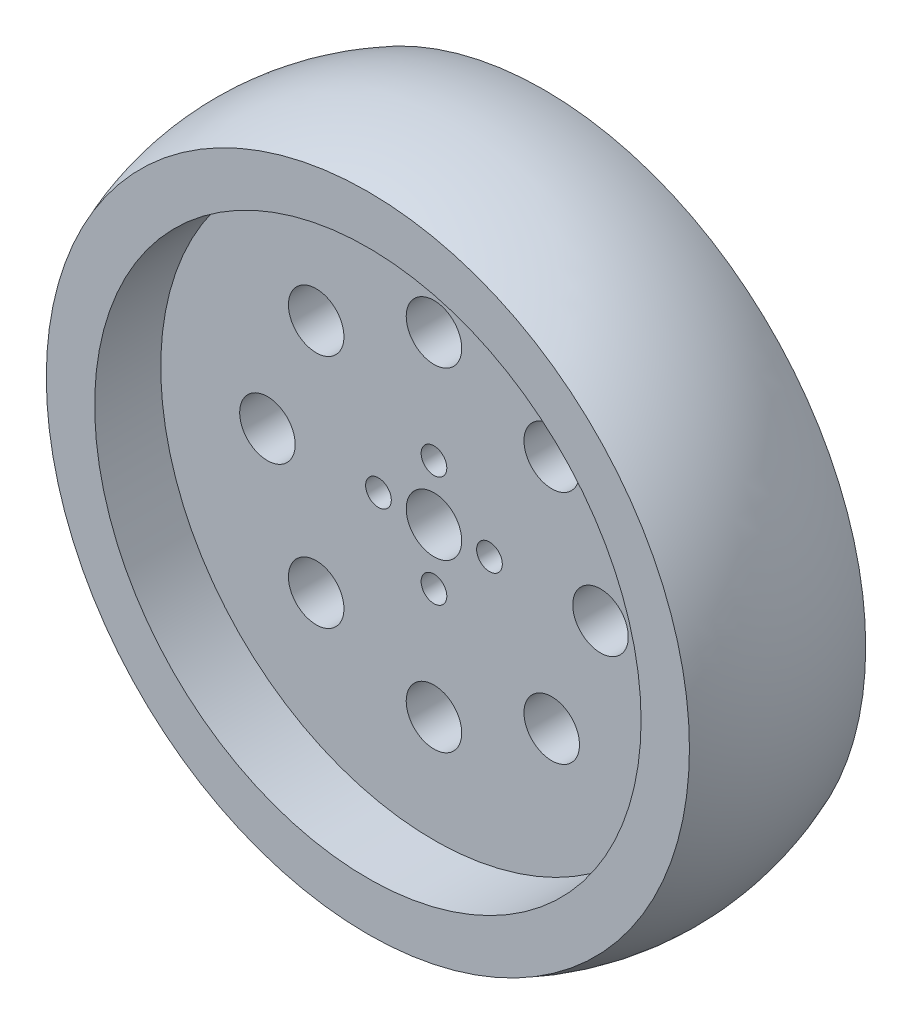
ISO-10303-21;
HEADER;
FILE_DESCRIPTION(('STEP AP214'),'2;1');
FILE_NAME('part.step','',(''),(''),'','','');
FILE_SCHEMA(('AUTOMOTIVE_DESIGN { 1 0 10303 214 1 1 1 1 }'));
ENDSEC;
DATA;
#1=APPLICATION_CONTEXT('core data for automotive mechanical design processes');
#2=APPLICATION_PROTOCOL_DEFINITION('international standard','automotive_design',2000,#1);
#3=PRODUCT_CONTEXT('',#1,'mechanical');
#4=PRODUCT('Part','Part','',(#3));
#5=PRODUCT_RELATED_PRODUCT_CATEGORY('part','',(#4));
#6=PRODUCT_DEFINITION_FORMATION('','',#4);
#7=PRODUCT_DEFINITION_CONTEXT('part definition',#1,'design');
#8=PRODUCT_DEFINITION('design','',#6,#7);
#9=PRODUCT_DEFINITION_SHAPE('','',#8);
#10=(LENGTH_UNIT() NAMED_UNIT(*) SI_UNIT(.MILLI.,.METRE.));
#11=(NAMED_UNIT(*) PLANE_ANGLE_UNIT() SI_UNIT($,.RADIAN.));
#12=(NAMED_UNIT(*) SI_UNIT($,.STERADIAN.) SOLID_ANGLE_UNIT());
#13=UNCERTAINTY_MEASURE_WITH_UNIT(LENGTH_MEASURE(1.E-05),#10,'distance_accuracy_value','');
#14=(GEOMETRIC_REPRESENTATION_CONTEXT(3) GLOBAL_UNCERTAINTY_ASSIGNED_CONTEXT((#13)) GLOBAL_UNIT_ASSIGNED_CONTEXT((#10,
#11,#12)) REPRESENTATION_CONTEXT('',''));
#15=CARTESIAN_POINT('',(0.,0.,0.));
#16=DIRECTION('',(0.,0.,1.));
#17=DIRECTION('',(1.,0.,0.));
#18=AXIS2_PLACEMENT_3D('',#15,#16,#17);
#19=CARTESIAN_POINT('',(3.78863607153335E-12,0.,-8.34401991944844E-13));
#20=DIRECTION('',(0.,0.,1.));
#21=DIRECTION('',(1.,0.,0.));
#22=AXIS2_PLACEMENT_3D('',#19,#20,#21);
#23=DEGENERATE_TOROIDAL_SURFACE('',#22,14.7999999999819,34.0000000000172,.T.);
#24=CARTESIAN_POINT('',(3.78863607153335E-12,0.,-12.7000000000016));
#25=DIRECTION('',(0.,0.,1.));
#26=DIRECTION('',(1.,0.,0.));
#27=AXIS2_PLACEMENT_3D('',#24,#25,#26);
#28=CIRCLE('',#27,46.3390234471521);
#29=CARTESIAN_POINT('',(46.3390234471558,0.,-12.7000000000016));
#30=VERTEX_POINT('',#29);
#31=EDGE_CURVE('E10',#30,#30,#28,.T.);
#32=ORIENTED_EDGE('',*,*,#31,.T.);
#33=EDGE_LOOP('',(#32));
#34=FACE_BOUND('',#33,.T.);
#35=CARTESIAN_POINT('',(3.78906975240234E-12,0.,12.7));
#36=DIRECTION('',(0.,0.,1.));
#37=DIRECTION('',(1.,0.,0.));
#38=AXIS2_PLACEMENT_3D('',#35,#36,#37);
#39=CIRCLE('',#38,46.339023447152);
#40=CARTESIAN_POINT('',(46.3390234471558,0.,12.7));
#41=VERTEX_POINT('',#40);
#42=EDGE_CURVE('E38',#41,#41,#39,.T.);
#43=ORIENTED_EDGE('',*,*,#42,.F.);
#44=EDGE_LOOP('',(#43));
#45=FACE_BOUND('',#44,.T.);
#46=ADVANCED_FACE('F32',(#34,#45),#23,.T.);
#47=CARTESIAN_POINT('',(46.3390234471558,0.,-12.7000000000016));
#48=DIRECTION('',(0.,0.,-1.));
#49=DIRECTION('',(-1.,0.,0.));
#50=AXIS2_PLACEMENT_3D('',#47,#48,#49);
#51=PLANE('',#50);
#52=CARTESIAN_POINT('',(0.,0.,-12.7));
#53=DIRECTION('',(0.,0.,1.));
#54=DIRECTION('',(1.,0.,0.));
#55=AXIS2_PLACEMENT_3D('',#52,#53,#54);
#56=CIRCLE('',#55,39.37);
#57=CARTESIAN_POINT('',(39.37,0.,-12.7));
#58=VERTEX_POINT('',#57);
#59=EDGE_CURVE('E42',#58,#58,#56,.T.);
#60=ORIENTED_EDGE('',*,*,#59,.T.);
#61=EDGE_LOOP('',(#60));
#62=FACE_BOUND('',#61,.T.);
#63=ORIENTED_EDGE('',*,*,#31,.F.);
#64=EDGE_LOOP('',(#63));
#65=FACE_BOUND('',#64,.T.);
#66=ADVANCED_FACE('F192',(#62,#65),#51,.T.);
#67=CARTESIAN_POINT('',(3.78906975240234E-12,0.,12.7));
#68=DIRECTION('',(0.,0.,1.));
#69=DIRECTION('',(1.,0.,0.));
#70=AXIS2_PLACEMENT_3D('',#67,#68,#69);
#71=PLANE('',#70);
#72=CARTESIAN_POINT('',(0.,0.,12.7));
#73=DIRECTION('',(0.,0.,1.));
#74=DIRECTION('',(1.,0.,0.));
#75=AXIS2_PLACEMENT_3D('',#72,#73,#74);
#76=CIRCLE('',#75,39.37);
#77=CARTESIAN_POINT('',(39.37,0.,12.7));
#78=VERTEX_POINT('',#77);
#79=EDGE_CURVE('E46',#78,#78,#76,.T.);
#80=ORIENTED_EDGE('',*,*,#79,.F.);
#81=EDGE_LOOP('',(#80));
#82=FACE_BOUND('',#81,.T.);
#83=ORIENTED_EDGE('',*,*,#42,.T.);
#84=EDGE_LOOP('',(#83));
#85=FACE_BOUND('',#84,.T.);
#86=ADVANCED_FACE('F190',(#82,#85),#71,.T.);
#87=CARTESIAN_POINT('',(0.,0.,-12.7));
#88=DIRECTION('',(0.,0.,1.));
#89=DIRECTION('',(1.,0.,0.));
#90=AXIS2_PLACEMENT_3D('',#87,#88,#89);
#91=CYLINDRICAL_SURFACE('',#90,39.37);
#92=ORIENTED_EDGE('',*,*,#59,.F.);
#93=EDGE_LOOP('',(#92));
#94=FACE_BOUND('',#93,.T.);
#95=CARTESIAN_POINT('',(0.,0.,-3.175));
#96=DIRECTION('',(0.,0.,1.));
#97=DIRECTION('',(1.,0.,0.));
#98=AXIS2_PLACEMENT_3D('',#95,#96,#97);
#99=CIRCLE('',#98,39.37);
#100=CARTESIAN_POINT('',(39.37,0.,-3.175));
#101=VERTEX_POINT('',#100);
#102=EDGE_CURVE('E60',#101,#101,#99,.T.);
#103=ORIENTED_EDGE('',*,*,#102,.T.);
#104=EDGE_LOOP('',(#103));
#105=FACE_BOUND('',#104,.T.);
#106=ADVANCED_FACE('F186',(#94,#105),#91,.F.);
#107=CARTESIAN_POINT('',(0.,0.,-12.7));
#108=DIRECTION('',(0.,0.,1.));
#109=DIRECTION('',(1.,0.,0.));
#110=AXIS2_PLACEMENT_3D('',#107,#108,#109);
#111=CYLINDRICAL_SURFACE('',#110,39.37);
#112=CARTESIAN_POINT('',(0.,0.,3.175));
#113=DIRECTION('',(0.,0.,1.));
#114=DIRECTION('',(1.,0.,0.));
#115=AXIS2_PLACEMENT_3D('',#112,#113,#114);
#116=CIRCLE('',#115,39.37);
#117=CARTESIAN_POINT('',(39.37,0.,3.175));
#118=VERTEX_POINT('',#117);
#119=EDGE_CURVE('E51',#118,#118,#116,.T.);
#120=ORIENTED_EDGE('',*,*,#119,.F.);
#121=EDGE_LOOP('',(#120));
#122=FACE_BOUND('',#121,.T.);
#123=ORIENTED_EDGE('',*,*,#79,.T.);
#124=EDGE_LOOP('',(#123));
#125=FACE_BOUND('',#124,.T.);
#126=ADVANCED_FACE('F179',(#122,#125),#111,.F.);
#127=CARTESIAN_POINT('',(39.37,0.,3.175));
#128=DIRECTION('',(0.,0.,-1.));
#129=DIRECTION('',(-1.,0.,0.));
#130=AXIS2_PLACEMENT_3D('',#127,#128,#129);
#131=PLANE('',#130);
#132=CARTESIAN_POINT('',(8.,0.,3.175));
#133=DIRECTION('',(0.,0.,-1.));
#134=DIRECTION('',(-1.,0.,0.));
#135=AXIS2_PLACEMENT_3D('',#132,#133,#134);
#136=CIRCLE('',#135,1.84999999999999);
#137=CARTESIAN_POINT('',(6.15000000000001,0.,3.175));
#138=VERTEX_POINT('',#137);
#139=EDGE_CURVE('E129',#138,#138,#136,.T.);
#140=ORIENTED_EDGE('',*,*,#139,.T.);
#141=EDGE_LOOP('',(#140));
#142=FACE_BOUND('',#141,.T.);
#143=CARTESIAN_POINT('',(0.,-8.,3.175));
#144=DIRECTION('',(0.,0.,-1.));
#145=DIRECTION('',(-1.,0.,0.));
#146=AXIS2_PLACEMENT_3D('',#143,#144,#145);
#147=CIRCLE('',#146,1.84999999999999);
#148=CARTESIAN_POINT('',(-1.84999999999999,-8.,3.175));
#149=VERTEX_POINT('',#148);
#150=EDGE_CURVE('E123',#149,#149,#147,.T.);
#151=ORIENTED_EDGE('',*,*,#150,.T.);
#152=EDGE_LOOP('',(#151));
#153=FACE_BOUND('',#152,.T.);
#154=CARTESIAN_POINT('',(-8.,0.,3.175));
#155=DIRECTION('',(0.,0.,-1.));
#156=DIRECTION('',(-1.,0.,0.));
#157=AXIS2_PLACEMENT_3D('',#154,#155,#156);
#158=CIRCLE('',#157,1.84999999999999);
#159=CARTESIAN_POINT('',(-9.84999999999999,0.,3.175));
#160=VERTEX_POINT('',#159);
#161=EDGE_CURVE('E117',#160,#160,#158,.T.);
#162=ORIENTED_EDGE('',*,*,#161,.T.);
#163=EDGE_LOOP('',(#162));
#164=FACE_BOUND('',#163,.T.);
#165=CARTESIAN_POINT('',(0.,8.,3.175));
#166=DIRECTION('',(0.,0.,-1.));
#167=DIRECTION('',(-1.,0.,0.));
#168=AXIS2_PLACEMENT_3D('',#165,#166,#167);
#169=CIRCLE('',#168,1.84999999999999);
#170=CARTESIAN_POINT('',(-1.84999999999999,8.,3.175));
#171=VERTEX_POINT('',#170);
#172=EDGE_CURVE('E111',#171,#171,#169,.T.);
#173=ORIENTED_EDGE('',*,*,#172,.T.);
#174=EDGE_LOOP('',(#173));
#175=FACE_BOUND('',#174,.T.);
#176=CARTESIAN_POINT('',(0.,-24.,3.175));
#177=DIRECTION('',(0.,0.,-1.));
#178=DIRECTION('',(-1.,0.,0.));
#179=AXIS2_PLACEMENT_3D('',#176,#177,#178);
#180=CIRCLE('',#179,3.99999999999999);
#181=CARTESIAN_POINT('',(-3.99999999999999,-24.,3.175));
#182=VERTEX_POINT('',#181);
#183=EDGE_CURVE('E105',#182,#182,#180,.T.);
#184=ORIENTED_EDGE('',*,*,#183,.T.);
#185=EDGE_LOOP('',(#184));
#186=FACE_BOUND('',#185,.T.);
#187=CARTESIAN_POINT('',(16.97056274848,-16.97056274848,3.175));
#188=DIRECTION('',(0.,0.,-1.));
#189=DIRECTION('',(-1.,0.,0.));
#190=AXIS2_PLACEMENT_3D('',#187,#188,#189);
#191=CIRCLE('',#190,3.99999999999999);
#192=CARTESIAN_POINT('',(12.97056274848,-16.97056274848,3.175));
#193=VERTEX_POINT('',#192);
#194=EDGE_CURVE('E99',#193,#193,#191,.T.);
#195=ORIENTED_EDGE('',*,*,#194,.T.);
#196=EDGE_LOOP('',(#195));
#197=FACE_BOUND('',#196,.T.);
#198=CARTESIAN_POINT('',(24.,0.,3.175));
#199=DIRECTION('',(0.,0.,-1.));
#200=DIRECTION('',(-1.,0.,0.));
#201=AXIS2_PLACEMENT_3D('',#198,#199,#200);
#202=CIRCLE('',#201,3.99999999999999);
#203=CARTESIAN_POINT('',(20.,0.,3.175));
#204=VERTEX_POINT('',#203);
#205=EDGE_CURVE('E93',#204,#204,#202,.T.);
#206=ORIENTED_EDGE('',*,*,#205,.T.);
#207=EDGE_LOOP('',(#206));
#208=FACE_BOUND('',#207,.T.);
#209=CARTESIAN_POINT('',(16.97056274848,16.97056274848,3.175));
#210=DIRECTION('',(0.,0.,-1.));
#211=DIRECTION('',(-1.,0.,0.));
#212=AXIS2_PLACEMENT_3D('',#209,#210,#211);
#213=CIRCLE('',#212,3.99999999999999);
#214=CARTESIAN_POINT('',(12.97056274848,16.97056274848,3.175));
#215=VERTEX_POINT('',#214);
#216=EDGE_CURVE('E87',#215,#215,#213,.T.);
#217=ORIENTED_EDGE('',*,*,#216,.T.);
#218=EDGE_LOOP('',(#217));
#219=FACE_BOUND('',#218,.T.);
#220=CARTESIAN_POINT('',(0.,24.,3.175));
#221=DIRECTION('',(0.,0.,-1.));
#222=DIRECTION('',(-1.,0.,0.));
#223=AXIS2_PLACEMENT_3D('',#220,#221,#222);
#224=CIRCLE('',#223,3.99999999999999);
#225=CARTESIAN_POINT('',(-3.99999999999999,24.,3.175));
#226=VERTEX_POINT('',#225);
#227=EDGE_CURVE('E81',#226,#226,#224,.T.);
#228=ORIENTED_EDGE('',*,*,#227,.T.);
#229=EDGE_LOOP('',(#228));
#230=FACE_BOUND('',#229,.T.);
#231=CARTESIAN_POINT('',(-16.97056274848,16.97056274848,3.175));
#232=DIRECTION('',(0.,0.,-1.));
#233=DIRECTION('',(-1.,0.,0.));
#234=AXIS2_PLACEMENT_3D('',#231,#232,#233);
#235=CIRCLE('',#234,3.99999999999999);
#236=CARTESIAN_POINT('',(-20.97056274848,16.97056274848,3.175));
#237=VERTEX_POINT('',#236);
#238=EDGE_CURVE('E75',#237,#237,#235,.T.);
#239=ORIENTED_EDGE('',*,*,#238,.T.);
#240=EDGE_LOOP('',(#239));
#241=FACE_BOUND('',#240,.T.);
#242=CARTESIAN_POINT('',(-24.,0.,3.175));
#243=DIRECTION('',(0.,0.,-1.));
#244=DIRECTION('',(-1.,0.,0.));
#245=AXIS2_PLACEMENT_3D('',#242,#243,#244);
#246=CIRCLE('',#245,3.99999999999999);
#247=CARTESIAN_POINT('',(-28.,0.,3.175));
#248=VERTEX_POINT('',#247);
#249=EDGE_CURVE('E69',#248,#248,#246,.T.);
#250=ORIENTED_EDGE('',*,*,#249,.T.);
#251=EDGE_LOOP('',(#250));
#252=FACE_BOUND('',#251,.T.);
#253=CARTESIAN_POINT('',(-16.97056274848,-16.97056274848,3.175));
#254=DIRECTION('',(0.,0.,-1.));
#255=DIRECTION('',(-1.,0.,0.));
#256=AXIS2_PLACEMENT_3D('',#253,#254,#255);
#257=CIRCLE('',#256,3.99999999999999);
#258=CARTESIAN_POINT('',(-20.97056274848,-16.97056274848,3.175));
#259=VERTEX_POINT('',#258);
#260=EDGE_CURVE('E63',#259,#259,#257,.T.);
#261=ORIENTED_EDGE('',*,*,#260,.T.);
#262=EDGE_LOOP('',(#261));
#263=FACE_BOUND('',#262,.T.);
#264=CARTESIAN_POINT('',(0.,0.,3.175));
#265=DIRECTION('',(0.,0.,1.));
#266=DIRECTION('',(1.,0.,0.));
#267=AXIS2_PLACEMENT_3D('',#264,#265,#266);
#268=CIRCLE('',#267,4.);
#269=CARTESIAN_POINT('',(4.,0.,3.175));
#270=VERTEX_POINT('',#269);
#271=EDGE_CURVE('E54',#270,#270,#268,.T.);
#272=ORIENTED_EDGE('',*,*,#271,.F.);
#273=EDGE_LOOP('',(#272));
#274=FACE_BOUND('',#273,.T.);
#275=ORIENTED_EDGE('',*,*,#119,.T.);
#276=EDGE_LOOP('',(#275));
#277=FACE_BOUND('',#276,.T.);
#278=ADVANCED_FACE('F173',(#142,#153,#164,#175,#186,#197,#208,#219,#230,#241,#252,#263,#274,
#277),#131,.F.);
#279=CARTESIAN_POINT('',(0.,0.,-12.7));
#280=DIRECTION('',(0.,0.,1.));
#281=DIRECTION('',(1.,0.,0.));
#282=AXIS2_PLACEMENT_3D('',#279,#280,#281);
#283=CYLINDRICAL_SURFACE('',#282,4.);
#284=CARTESIAN_POINT('',(0.,0.,-3.175));
#285=DIRECTION('',(0.,0.,1.));
#286=DIRECTION('',(1.,0.,0.));
#287=AXIS2_PLACEMENT_3D('',#284,#285,#286);
#288=CIRCLE('',#287,4.);
#289=CARTESIAN_POINT('',(4.,0.,-3.175));
#290=VERTEX_POINT('',#289);
#291=EDGE_CURVE('E57',#290,#290,#288,.T.);
#292=ORIENTED_EDGE('',*,*,#291,.F.);
#293=EDGE_LOOP('',(#292));
#294=FACE_BOUND('',#293,.T.);
#295=ORIENTED_EDGE('',*,*,#271,.T.);
#296=EDGE_LOOP('',(#295));
#297=FACE_BOUND('',#296,.T.);
#298=ADVANCED_FACE('F143',(#294,#297),#283,.F.);
#299=CARTESIAN_POINT('',(4.,0.,-3.175));
#300=DIRECTION('',(0.,0.,1.));
#301=DIRECTION('',(1.,0.,0.));
#302=AXIS2_PLACEMENT_3D('',#299,#300,#301);
#303=PLANE('',#302);
#304=CARTESIAN_POINT('',(8.,0.,-3.175));
#305=DIRECTION('',(0.,0.,-1.));
#306=DIRECTION('',(-1.,0.,0.));
#307=AXIS2_PLACEMENT_3D('',#304,#305,#306);
#308=CIRCLE('',#307,1.84999999999999);
#309=CARTESIAN_POINT('',(6.15000000000001,0.,-3.175));
#310=VERTEX_POINT('',#309);
#311=EDGE_CURVE('E132',#310,#310,#308,.T.);
#312=ORIENTED_EDGE('',*,*,#311,.F.);
#313=EDGE_LOOP('',(#312));
#314=FACE_BOUND('',#313,.T.);
#315=CARTESIAN_POINT('',(0.,-8.,-3.175));
#316=DIRECTION('',(0.,0.,-1.));
#317=DIRECTION('',(-1.,0.,0.));
#318=AXIS2_PLACEMENT_3D('',#315,#316,#317);
#319=CIRCLE('',#318,1.84999999999999);
#320=CARTESIAN_POINT('',(-1.84999999999999,-8.,-3.175));
#321=VERTEX_POINT('',#320);
#322=EDGE_CURVE('E126',#321,#321,#319,.T.);
#323=ORIENTED_EDGE('',*,*,#322,.F.);
#324=EDGE_LOOP('',(#323));
#325=FACE_BOUND('',#324,.T.);
#326=CARTESIAN_POINT('',(-8.,0.,-3.175));
#327=DIRECTION('',(0.,0.,-1.));
#328=DIRECTION('',(-1.,0.,0.));
#329=AXIS2_PLACEMENT_3D('',#326,#327,#328);
#330=CIRCLE('',#329,1.84999999999999);
#331=CARTESIAN_POINT('',(-9.84999999999999,0.,-3.175));
#332=VERTEX_POINT('',#331);
#333=EDGE_CURVE('E120',#332,#332,#330,.T.);
#334=ORIENTED_EDGE('',*,*,#333,.F.);
#335=EDGE_LOOP('',(#334));
#336=FACE_BOUND('',#335,.T.);
#337=CARTESIAN_POINT('',(0.,8.,-3.175));
#338=DIRECTION('',(0.,0.,-1.));
#339=DIRECTION('',(-1.,0.,0.));
#340=AXIS2_PLACEMENT_3D('',#337,#338,#339);
#341=CIRCLE('',#340,1.84999999999999);
#342=CARTESIAN_POINT('',(-1.84999999999999,8.,-3.175));
#343=VERTEX_POINT('',#342);
#344=EDGE_CURVE('E114',#343,#343,#341,.T.);
#345=ORIENTED_EDGE('',*,*,#344,.F.);
#346=EDGE_LOOP('',(#345));
#347=FACE_BOUND('',#346,.T.);
#348=CARTESIAN_POINT('',(0.,-24.,-3.175));
#349=DIRECTION('',(0.,0.,-1.));
#350=DIRECTION('',(-1.,0.,0.));
#351=AXIS2_PLACEMENT_3D('',#348,#349,#350);
#352=CIRCLE('',#351,3.99999999999999);
#353=CARTESIAN_POINT('',(-3.99999999999999,-24.,-3.175));
#354=VERTEX_POINT('',#353);
#355=EDGE_CURVE('E108',#354,#354,#352,.T.);
#356=ORIENTED_EDGE('',*,*,#355,.F.);
#357=EDGE_LOOP('',(#356));
#358=FACE_BOUND('',#357,.T.);
#359=CARTESIAN_POINT('',(16.97056274848,-16.97056274848,-3.175));
#360=DIRECTION('',(0.,0.,-1.));
#361=DIRECTION('',(-1.,0.,0.));
#362=AXIS2_PLACEMENT_3D('',#359,#360,#361);
#363=CIRCLE('',#362,3.99999999999999);
#364=CARTESIAN_POINT('',(12.97056274848,-16.97056274848,-3.175));
#365=VERTEX_POINT('',#364);
#366=EDGE_CURVE('E102',#365,#365,#363,.T.);
#367=ORIENTED_EDGE('',*,*,#366,.F.);
#368=EDGE_LOOP('',(#367));
#369=FACE_BOUND('',#368,.T.);
#370=CARTESIAN_POINT('',(24.,0.,-3.175));
#371=DIRECTION('',(0.,0.,-1.));
#372=DIRECTION('',(-1.,0.,0.));
#373=AXIS2_PLACEMENT_3D('',#370,#371,#372);
#374=CIRCLE('',#373,3.99999999999999);
#375=CARTESIAN_POINT('',(20.,0.,-3.175));
#376=VERTEX_POINT('',#375);
#377=EDGE_CURVE('E96',#376,#376,#374,.T.);
#378=ORIENTED_EDGE('',*,*,#377,.F.);
#379=EDGE_LOOP('',(#378));
#380=FACE_BOUND('',#379,.T.);
#381=CARTESIAN_POINT('',(16.97056274848,16.97056274848,-3.175));
#382=DIRECTION('',(0.,0.,-1.));
#383=DIRECTION('',(-1.,0.,0.));
#384=AXIS2_PLACEMENT_3D('',#381,#382,#383);
#385=CIRCLE('',#384,3.99999999999999);
#386=CARTESIAN_POINT('',(12.97056274848,16.97056274848,-3.175));
#387=VERTEX_POINT('',#386);
#388=EDGE_CURVE('E90',#387,#387,#385,.T.);
#389=ORIENTED_EDGE('',*,*,#388,.F.);
#390=EDGE_LOOP('',(#389));
#391=FACE_BOUND('',#390,.T.);
#392=CARTESIAN_POINT('',(0.,24.,-3.175));
#393=DIRECTION('',(0.,0.,-1.));
#394=DIRECTION('',(-1.,0.,0.));
#395=AXIS2_PLACEMENT_3D('',#392,#393,#394);
#396=CIRCLE('',#395,3.99999999999999);
#397=CARTESIAN_POINT('',(-3.99999999999999,24.,-3.175));
#398=VERTEX_POINT('',#397);
#399=EDGE_CURVE('E84',#398,#398,#396,.T.);
#400=ORIENTED_EDGE('',*,*,#399,.F.);
#401=EDGE_LOOP('',(#400));
#402=FACE_BOUND('',#401,.T.);
#403=CARTESIAN_POINT('',(-16.97056274848,16.97056274848,-3.175));
#404=DIRECTION('',(0.,0.,-1.));
#405=DIRECTION('',(-1.,0.,0.));
#406=AXIS2_PLACEMENT_3D('',#403,#404,#405);
#407=CIRCLE('',#406,3.99999999999999);
#408=CARTESIAN_POINT('',(-20.97056274848,16.97056274848,-3.175));
#409=VERTEX_POINT('',#408);
#410=EDGE_CURVE('E78',#409,#409,#407,.T.);
#411=ORIENTED_EDGE('',*,*,#410,.F.);
#412=EDGE_LOOP('',(#411));
#413=FACE_BOUND('',#412,.T.);
#414=CARTESIAN_POINT('',(-24.,0.,-3.175));
#415=DIRECTION('',(0.,0.,-1.));
#416=DIRECTION('',(-1.,0.,0.));
#417=AXIS2_PLACEMENT_3D('',#414,#415,#416);
#418=CIRCLE('',#417,3.99999999999999);
#419=CARTESIAN_POINT('',(-28.,0.,-3.175));
#420=VERTEX_POINT('',#419);
#421=EDGE_CURVE('E72',#420,#420,#418,.T.);
#422=ORIENTED_EDGE('',*,*,#421,.F.);
#423=EDGE_LOOP('',(#422));
#424=FACE_BOUND('',#423,.T.);
#425=CARTESIAN_POINT('',(-16.97056274848,-16.97056274848,-3.175));
#426=DIRECTION('',(0.,0.,-1.));
#427=DIRECTION('',(-1.,0.,0.));
#428=AXIS2_PLACEMENT_3D('',#425,#426,#427);
#429=CIRCLE('',#428,3.99999999999999);
#430=CARTESIAN_POINT('',(-20.97056274848,-16.97056274848,-3.175));
#431=VERTEX_POINT('',#430);
#432=EDGE_CURVE('E66',#431,#431,#429,.T.);
#433=ORIENTED_EDGE('',*,*,#432,.F.);
#434=EDGE_LOOP('',(#433));
#435=FACE_BOUND('',#434,.T.);
#436=ORIENTED_EDGE('',*,*,#102,.F.);
#437=EDGE_LOOP('',(#436));
#438=FACE_BOUND('',#437,.T.);
#439=ORIENTED_EDGE('',*,*,#291,.T.);
#440=EDGE_LOOP('',(#439));
#441=FACE_BOUND('',#440,.T.);
#442=ADVANCED_FACE('F139',(#314,#325,#336,#347,#358,#369,#380,#391,#402,#413,#424,#435,#438,
#441),#303,.F.);
#443=CARTESIAN_POINT('',(-16.97056274848,-16.97056274848,-3.175));
#444=DIRECTION('',(0.,0.,-1.));
#445=DIRECTION('',(-1.,0.,0.));
#446=AXIS2_PLACEMENT_3D('',#443,#444,#445);
#447=CYLINDRICAL_SURFACE('',#446,3.99999999999999);
#448=ORIENTED_EDGE('',*,*,#432,.T.);
#449=EDGE_LOOP('',(#448));
#450=FACE_BOUND('',#449,.T.);
#451=ORIENTED_EDGE('',*,*,#260,.F.);
#452=EDGE_LOOP('',(#451));
#453=FACE_BOUND('',#452,.T.);
#454=ADVANCED_FACE('F142',(#450,#453),#447,.F.);
#455=CARTESIAN_POINT('',(-24.,0.,-3.175));
#456=DIRECTION('',(0.,0.,-1.));
#457=DIRECTION('',(-1.,0.,0.));
#458=AXIS2_PLACEMENT_3D('',#455,#456,#457);
#459=CYLINDRICAL_SURFACE('',#458,3.99999999999999);
#460=ORIENTED_EDGE('',*,*,#421,.T.);
#461=EDGE_LOOP('',(#460));
#462=FACE_BOUND('',#461,.T.);
#463=ORIENTED_EDGE('',*,*,#249,.F.);
#464=EDGE_LOOP('',(#463));
#465=FACE_BOUND('',#464,.T.);
#466=ADVANCED_FACE('F245',(#462,#465),#459,.F.);
#467=CARTESIAN_POINT('',(-16.97056274848,16.97056274848,-3.175));
#468=DIRECTION('',(0.,0.,-1.));
#469=DIRECTION('',(-1.,0.,0.));
#470=AXIS2_PLACEMENT_3D('',#467,#468,#469);
#471=CYLINDRICAL_SURFACE('',#470,3.99999999999999);
#472=ORIENTED_EDGE('',*,*,#410,.T.);
#473=EDGE_LOOP('',(#472));
#474=FACE_BOUND('',#473,.T.);
#475=ORIENTED_EDGE('',*,*,#238,.F.);
#476=EDGE_LOOP('',(#475));
#477=FACE_BOUND('',#476,.T.);
#478=ADVANCED_FACE('F255',(#474,#477),#471,.F.);
#479=CARTESIAN_POINT('',(0.,24.,-3.175));
#480=DIRECTION('',(0.,0.,-1.));
#481=DIRECTION('',(-1.,0.,0.));
#482=AXIS2_PLACEMENT_3D('',#479,#480,#481);
#483=CYLINDRICAL_SURFACE('',#482,3.99999999999999);
#484=ORIENTED_EDGE('',*,*,#399,.T.);
#485=EDGE_LOOP('',(#484));
#486=FACE_BOUND('',#485,.T.);
#487=ORIENTED_EDGE('',*,*,#227,.F.);
#488=EDGE_LOOP('',(#487));
#489=FACE_BOUND('',#488,.T.);
#490=ADVANCED_FACE('F265',(#486,#489),#483,.F.);
#491=CARTESIAN_POINT('',(16.97056274848,16.97056274848,-3.175));
#492=DIRECTION('',(0.,0.,-1.));
#493=DIRECTION('',(-1.,0.,0.));
#494=AXIS2_PLACEMENT_3D('',#491,#492,#493);
#495=CYLINDRICAL_SURFACE('',#494,3.99999999999999);
#496=ORIENTED_EDGE('',*,*,#388,.T.);
#497=EDGE_LOOP('',(#496));
#498=FACE_BOUND('',#497,.T.);
#499=ORIENTED_EDGE('',*,*,#216,.F.);
#500=EDGE_LOOP('',(#499));
#501=FACE_BOUND('',#500,.T.);
#502=ADVANCED_FACE('F275',(#498,#501),#495,.F.);
#503=CARTESIAN_POINT('',(24.,0.,-3.175));
#504=DIRECTION('',(0.,0.,-1.));
#505=DIRECTION('',(-1.,0.,0.));
#506=AXIS2_PLACEMENT_3D('',#503,#504,#505);
#507=CYLINDRICAL_SURFACE('',#506,3.99999999999999);
#508=ORIENTED_EDGE('',*,*,#377,.T.);
#509=EDGE_LOOP('',(#508));
#510=FACE_BOUND('',#509,.T.);
#511=ORIENTED_EDGE('',*,*,#205,.F.);
#512=EDGE_LOOP('',(#511));
#513=FACE_BOUND('',#512,.T.);
#514=ADVANCED_FACE('F285',(#510,#513),#507,.F.);
#515=CARTESIAN_POINT('',(16.97056274848,-16.97056274848,-3.175));
#516=DIRECTION('',(0.,0.,-1.));
#517=DIRECTION('',(-1.,0.,0.));
#518=AXIS2_PLACEMENT_3D('',#515,#516,#517);
#519=CYLINDRICAL_SURFACE('',#518,3.99999999999999);
#520=ORIENTED_EDGE('',*,*,#366,.T.);
#521=EDGE_LOOP('',(#520));
#522=FACE_BOUND('',#521,.T.);
#523=ORIENTED_EDGE('',*,*,#194,.F.);
#524=EDGE_LOOP('',(#523));
#525=FACE_BOUND('',#524,.T.);
#526=ADVANCED_FACE('F295',(#522,#525),#519,.F.);
#527=CARTESIAN_POINT('',(0.,-24.,-3.175));
#528=DIRECTION('',(0.,0.,-1.));
#529=DIRECTION('',(-1.,0.,0.));
#530=AXIS2_PLACEMENT_3D('',#527,#528,#529);
#531=CYLINDRICAL_SURFACE('',#530,3.99999999999999);
#532=ORIENTED_EDGE('',*,*,#355,.T.);
#533=EDGE_LOOP('',(#532));
#534=FACE_BOUND('',#533,.T.);
#535=ORIENTED_EDGE('',*,*,#183,.F.);
#536=EDGE_LOOP('',(#535));
#537=FACE_BOUND('',#536,.T.);
#538=ADVANCED_FACE('F305',(#534,#537),#531,.F.);
#539=CARTESIAN_POINT('',(0.,8.,-3.175));
#540=DIRECTION('',(0.,0.,-1.));
#541=DIRECTION('',(-1.,0.,0.));
#542=AXIS2_PLACEMENT_3D('',#539,#540,#541);
#543=CYLINDRICAL_SURFACE('',#542,1.84999999999999);
#544=ORIENTED_EDGE('',*,*,#344,.T.);
#545=EDGE_LOOP('',(#544));
#546=FACE_BOUND('',#545,.T.);
#547=ORIENTED_EDGE('',*,*,#172,.F.);
#548=EDGE_LOOP('',(#547));
#549=FACE_BOUND('',#548,.T.);
#550=ADVANCED_FACE('F315',(#546,#549),#543,.F.);
#551=CARTESIAN_POINT('',(-8.,0.,-3.175));
#552=DIRECTION('',(0.,0.,-1.));
#553=DIRECTION('',(-1.,0.,0.));
#554=AXIS2_PLACEMENT_3D('',#551,#552,#553);
#555=CYLINDRICAL_SURFACE('',#554,1.84999999999999);
#556=ORIENTED_EDGE('',*,*,#333,.T.);
#557=EDGE_LOOP('',(#556));
#558=FACE_BOUND('',#557,.T.);
#559=ORIENTED_EDGE('',*,*,#161,.F.);
#560=EDGE_LOOP('',(#559));
#561=FACE_BOUND('',#560,.T.);
#562=ADVANCED_FACE('F335',(#558,#561),#555,.F.);
#563=CARTESIAN_POINT('',(0.,-8.,-3.175));
#564=DIRECTION('',(0.,0.,-1.));
#565=DIRECTION('',(-1.,0.,0.));
#566=AXIS2_PLACEMENT_3D('',#563,#564,#565);
#567=CYLINDRICAL_SURFACE('',#566,1.84999999999999);
#568=ORIENTED_EDGE('',*,*,#322,.T.);
#569=EDGE_LOOP('',(#568));
#570=FACE_BOUND('',#569,.T.);
#571=ORIENTED_EDGE('',*,*,#150,.F.);
#572=EDGE_LOOP('',(#571));
#573=FACE_BOUND('',#572,.T.);
#574=ADVANCED_FACE('F345',(#570,#573),#567,.F.);
#575=CARTESIAN_POINT('',(8.,0.,-3.175));
#576=DIRECTION('',(0.,0.,-1.));
#577=DIRECTION('',(-1.,0.,0.));
#578=AXIS2_PLACEMENT_3D('',#575,#576,#577);
#579=CYLINDRICAL_SURFACE('',#578,1.84999999999999);
#580=ORIENTED_EDGE('',*,*,#311,.T.);
#581=EDGE_LOOP('',(#580));
#582=FACE_BOUND('',#581,.T.);
#583=ORIENTED_EDGE('',*,*,#139,.F.);
#584=EDGE_LOOP('',(#583));
#585=FACE_BOUND('',#584,.T.);
#586=ADVANCED_FACE('F136',(#582,#585),#579,.F.);
#587=CLOSED_SHELL('',(#46,#66,#86,#106,#126,#278,#298,#442,#454,#466,#478,#490,#502,#514,#526,
#538,#550,#562,#574,#586));
#588=MANIFOLD_SOLID_BREP('B2',#587);
#589=ADVANCED_BREP_SHAPE_REPRESENTATION('',(#18,#588),#14);
#590=SHAPE_DEFINITION_REPRESENTATION(#9,#589);
ENDSEC;
END-ISO-10303-21;
